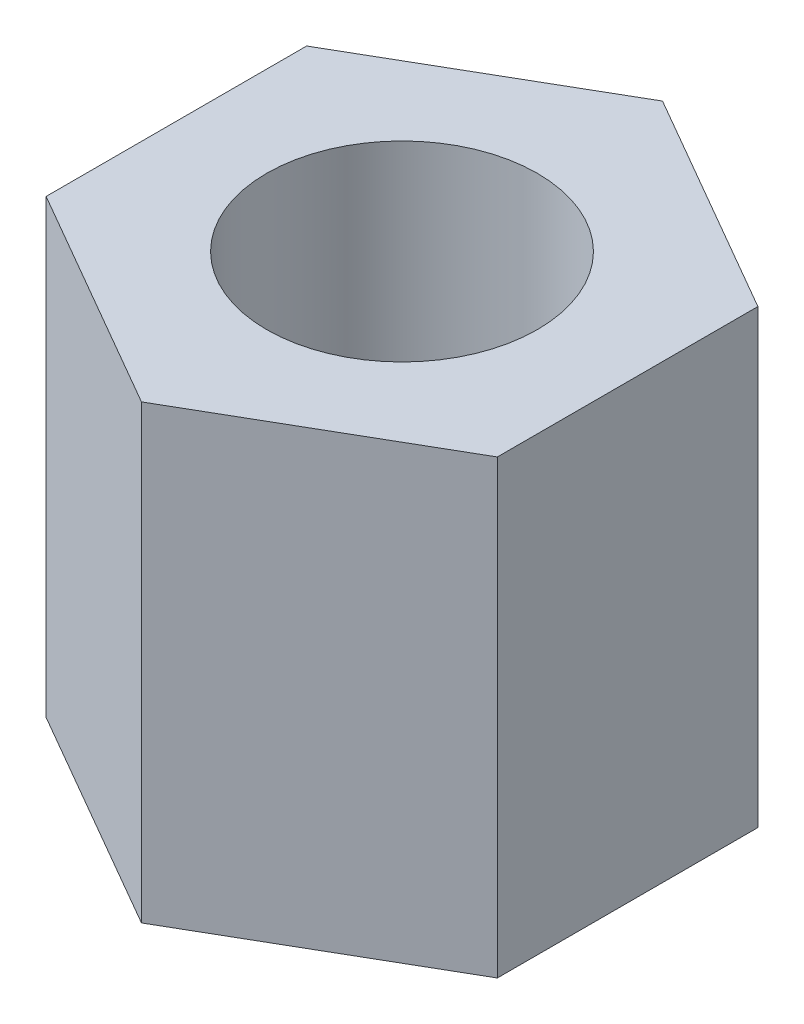
ISO-10303-21;
HEADER;
FILE_DESCRIPTION(('STEP AP214'),'2;1');
FILE_NAME('part.step','',(''),(''),'','','');
FILE_SCHEMA(('AUTOMOTIVE_DESIGN { 1 0 10303 214 1 1 1 1 }'));
ENDSEC;
DATA;
#1=APPLICATION_CONTEXT('core data for automotive mechanical design processes');
#2=APPLICATION_PROTOCOL_DEFINITION('international standard','automotive_design',2000,#1);
#3=PRODUCT_CONTEXT('',#1,'mechanical');
#4=PRODUCT('Part','Part','',(#3));
#5=PRODUCT_RELATED_PRODUCT_CATEGORY('part','',(#4));
#6=PRODUCT_DEFINITION_FORMATION('','',#4);
#7=PRODUCT_DEFINITION_CONTEXT('part definition',#1,'design');
#8=PRODUCT_DEFINITION('design','',#6,#7);
#9=PRODUCT_DEFINITION_SHAPE('','',#8);
#10=(LENGTH_UNIT() NAMED_UNIT(*) SI_UNIT(.MILLI.,.METRE.));
#11=(NAMED_UNIT(*) PLANE_ANGLE_UNIT() SI_UNIT($,.RADIAN.));
#12=(NAMED_UNIT(*) SI_UNIT($,.STERADIAN.) SOLID_ANGLE_UNIT());
#13=UNCERTAINTY_MEASURE_WITH_UNIT(LENGTH_MEASURE(1.E-05),#10,'distance_accuracy_value','');
#14=(GEOMETRIC_REPRESENTATION_CONTEXT(3) GLOBAL_UNCERTAINTY_ASSIGNED_CONTEXT((#13)) GLOBAL_UNIT_ASSIGNED_CONTEXT((#10,
#11,#12)) REPRESENTATION_CONTEXT('',''));
#15=CARTESIAN_POINT('',(0.,0.,0.));
#16=DIRECTION('',(0.,0.,1.));
#17=DIRECTION('',(1.,0.,0.));
#18=AXIS2_PLACEMENT_3D('',#15,#16,#17);
#19=CARTESIAN_POINT('',(0.,5.,0.));
#20=DIRECTION('',(0.,1.,0.));
#21=DIRECTION('',(0.,0.,1.));
#22=AXIS2_PLACEMENT_3D('',#19,#20,#21);
#23=PLANE('',#22);
#24=DIRECTION('',(-0.866025403784439,0.,-0.5));
#25=VECTOR('',#24,1.);
#26=CARTESIAN_POINT('',(2.5,5.,-1.44337567297407));
#27=LINE('',#26,#25);
#28=CARTESIAN_POINT('',(2.5,5.,-1.44337567297407));
#29=VERTEX_POINT('',#28);
#30=CARTESIAN_POINT('',(0.,5.,-2.88675134594813));
#31=VERTEX_POINT('',#30);
#32=EDGE_CURVE('E129',#29,#31,#27,.T.);
#33=ORIENTED_EDGE('',*,*,#32,.T.);
#34=DIRECTION('',(-0.866025403784439,0.,0.5));
#35=VECTOR('',#34,1.);
#36=CARTESIAN_POINT('',(0.,5.,-2.88675134594813));
#37=LINE('',#36,#35);
#38=CARTESIAN_POINT('',(-2.5,5.,-1.44337567297407));
#39=VERTEX_POINT('',#38);
#40=EDGE_CURVE('E87',#31,#39,#37,.T.);
#41=ORIENTED_EDGE('',*,*,#40,.T.);
#42=DIRECTION('',(0.,0.,1.));
#43=VECTOR('',#42,1.);
#44=CARTESIAN_POINT('',(-2.5,5.,-1.44337567297407));
#45=LINE('',#44,#43);
#46=CARTESIAN_POINT('',(-2.5,5.,1.44337567297406));
#47=VERTEX_POINT('',#46);
#48=EDGE_CURVE('E100',#39,#47,#45,.T.);
#49=ORIENTED_EDGE('',*,*,#48,.T.);
#50=DIRECTION('',(0.866025403784439,0.,0.5));
#51=VECTOR('',#50,1.);
#52=CARTESIAN_POINT('',(-2.5,5.,1.44337567297406));
#53=LINE('',#52,#51);
#54=CARTESIAN_POINT('',(0.,5.,2.88675134594813));
#55=VERTEX_POINT('',#54);
#56=EDGE_CURVE('E94',#47,#55,#53,.T.);
#57=ORIENTED_EDGE('',*,*,#56,.T.);
#58=DIRECTION('',(0.866025403784439,0.,-0.5));
#59=VECTOR('',#58,1.);
#60=CARTESIAN_POINT('',(0.,5.,2.88675134594813));
#61=LINE('',#60,#59);
#62=CARTESIAN_POINT('',(2.5,5.,1.44337567297407));
#63=VERTEX_POINT('',#62);
#64=EDGE_CURVE('E98',#55,#63,#61,.T.);
#65=ORIENTED_EDGE('',*,*,#64,.T.);
#66=DIRECTION('',(0.,0.,-1.));
#67=VECTOR('',#66,1.);
#68=CARTESIAN_POINT('',(2.5,5.,1.44337567297407));
#69=LINE('',#68,#67);
#70=EDGE_CURVE('E50',#63,#29,#69,.T.);
#71=ORIENTED_EDGE('',*,*,#70,.T.);
#72=EDGE_LOOP('',(#33,#41,#49,#57,#65,#71));
#73=FACE_BOUND('',#72,.T.);
#74=CARTESIAN_POINT('',(0.,5.,0.));
#75=DIRECTION('',(0.,1.,0.));
#76=DIRECTION('',(0.,0.,1.));
#77=AXIS2_PLACEMENT_3D('',#74,#75,#76);
#78=CIRCLE('',#77,1.5);
#79=CARTESIAN_POINT('',(0.,5.,1.5));
#80=VERTEX_POINT('',#79);
#81=EDGE_CURVE('E122',#80,#80,#78,.T.);
#82=ORIENTED_EDGE('',*,*,#81,.F.);
#83=EDGE_LOOP('',(#82));
#84=FACE_BOUND('',#83,.T.);
#85=ADVANCED_FACE('F33',(#73,#84),#23,.T.);
#86=CARTESIAN_POINT('',(0.,0.,0.));
#87=DIRECTION('',(0.,1.,0.));
#88=DIRECTION('',(0.,0.,1.));
#89=AXIS2_PLACEMENT_3D('',#86,#87,#88);
#90=PLANE('',#89);
#91=DIRECTION('',(-0.866025403784439,0.,-0.5));
#92=VECTOR('',#91,1.);
#93=CARTESIAN_POINT('',(2.5,0.,-1.44337567297407));
#94=LINE('',#93,#92);
#95=CARTESIAN_POINT('',(2.5,0.,-1.44337567297407));
#96=VERTEX_POINT('',#95);
#97=CARTESIAN_POINT('',(0.,0.,-2.88675134594813));
#98=VERTEX_POINT('',#97);
#99=EDGE_CURVE('E118',#96,#98,#94,.T.);
#100=ORIENTED_EDGE('',*,*,#99,.F.);
#101=DIRECTION('',(0.,0.,-1.));
#102=VECTOR('',#101,1.);
#103=CARTESIAN_POINT('',(2.5,0.,1.44337567297407));
#104=LINE('',#103,#102);
#105=CARTESIAN_POINT('',(2.5,0.,1.44337567297407));
#106=VERTEX_POINT('',#105);
#107=EDGE_CURVE('E79',#106,#96,#104,.T.);
#108=ORIENTED_EDGE('',*,*,#107,.F.);
#109=DIRECTION('',(0.866025403784439,0.,-0.5));
#110=VECTOR('',#109,1.);
#111=CARTESIAN_POINT('',(0.,0.,2.88675134594813));
#112=LINE('',#111,#110);
#113=CARTESIAN_POINT('',(0.,0.,2.88675134594813));
#114=VERTEX_POINT('',#113);
#115=EDGE_CURVE('E73',#114,#106,#112,.T.);
#116=ORIENTED_EDGE('',*,*,#115,.F.);
#117=DIRECTION('',(0.866025403784439,0.,0.5));
#118=VECTOR('',#117,1.);
#119=CARTESIAN_POINT('',(-2.5,0.,1.44337567297406));
#120=LINE('',#119,#118);
#121=CARTESIAN_POINT('',(-2.5,0.,1.44337567297406));
#122=VERTEX_POINT('',#121);
#123=EDGE_CURVE('E108',#122,#114,#120,.T.);
#124=ORIENTED_EDGE('',*,*,#123,.F.);
#125=DIRECTION('',(0.,0.,1.));
#126=VECTOR('',#125,1.);
#127=CARTESIAN_POINT('',(-2.5,0.,-1.44337567297407));
#128=LINE('',#127,#126);
#129=CARTESIAN_POINT('',(-2.5,0.,-1.44337567297407));
#130=VERTEX_POINT('',#129);
#131=EDGE_CURVE('E124',#130,#122,#128,.T.);
#132=ORIENTED_EDGE('',*,*,#131,.F.);
#133=DIRECTION('',(-0.866025403784439,0.,0.5));
#134=VECTOR('',#133,1.);
#135=CARTESIAN_POINT('',(0.,0.,-2.88675134594813));
#136=LINE('',#135,#134);
#137=EDGE_CURVE('E121',#98,#130,#136,.T.);
#138=ORIENTED_EDGE('',*,*,#137,.F.);
#139=EDGE_LOOP('',(#100,#108,#116,#124,#132,#138));
#140=FACE_BOUND('',#139,.T.);
#141=CARTESIAN_POINT('',(0.,0.,0.));
#142=DIRECTION('',(0.,1.,0.));
#143=DIRECTION('',(0.,0.,1.));
#144=AXIS2_PLACEMENT_3D('',#141,#142,#143);
#145=CIRCLE('',#144,1.5);
#146=CARTESIAN_POINT('',(0.,0.,1.5));
#147=VERTEX_POINT('',#146);
#148=EDGE_CURVE('E222',#147,#147,#145,.T.);
#149=ORIENTED_EDGE('',*,*,#148,.T.);
#150=EDGE_LOOP('',(#149));
#151=FACE_BOUND('',#150,.T.);
#152=ADVANCED_FACE('F138',(#140,#151),#90,.F.);
#153=CARTESIAN_POINT('',(2.5,5.,-1.44337567297407));
#154=DIRECTION('',(-0.5,0.,0.866025403784439));
#155=DIRECTION('',(0.866025403784439,0.,0.5));
#156=AXIS2_PLACEMENT_3D('',#153,#154,#155);
#157=PLANE('',#156);
#158=ORIENTED_EDGE('',*,*,#99,.T.);
#159=DIRECTION('',(0.,-1.,0.));
#160=VECTOR('',#159,1.);
#161=CARTESIAN_POINT('',(0.,5.,-2.88675134594813));
#162=LINE('',#161,#160);
#163=EDGE_CURVE('E11',#31,#98,#162,.T.);
#164=ORIENTED_EDGE('',*,*,#163,.F.);
#165=ORIENTED_EDGE('',*,*,#32,.F.);
#166=DIRECTION('',(0.,-1.,0.));
#167=VECTOR('',#166,1.);
#168=CARTESIAN_POINT('',(2.5,5.,-1.44337567297407));
#169=LINE('',#168,#167);
#170=EDGE_CURVE('E114',#29,#96,#169,.T.);
#171=ORIENTED_EDGE('',*,*,#170,.T.);
#172=EDGE_LOOP('',(#158,#164,#165,#171));
#173=FACE_BOUND('',#172,.T.);
#174=ADVANCED_FACE('F35',(#173),#157,.F.);
#175=CARTESIAN_POINT('',(0.,5.,-2.88675134594813));
#176=DIRECTION('',(0.5,0.,0.866025403784439));
#177=DIRECTION('',(0.866025403784439,0.,-0.5));
#178=AXIS2_PLACEMENT_3D('',#175,#176,#177);
#179=PLANE('',#178);
#180=ORIENTED_EDGE('',*,*,#137,.T.);
#181=DIRECTION('',(0.,-1.,0.));
#182=VECTOR('',#181,1.);
#183=CARTESIAN_POINT('',(-2.5,5.,-1.44337567297407));
#184=LINE('',#183,#182);
#185=EDGE_CURVE('E42',#39,#130,#184,.T.);
#186=ORIENTED_EDGE('',*,*,#185,.F.);
#187=ORIENTED_EDGE('',*,*,#40,.F.);
#188=ORIENTED_EDGE('',*,*,#163,.T.);
#189=EDGE_LOOP('',(#180,#186,#187,#188));
#190=FACE_BOUND('',#189,.T.);
#191=ADVANCED_FACE('F163',(#190),#179,.F.);
#192=CARTESIAN_POINT('',(-2.5,5.,-1.44337567297407));
#193=DIRECTION('',(1.,0.,0.));
#194=DIRECTION('',(0.,0.,-1.));
#195=AXIS2_PLACEMENT_3D('',#192,#193,#194);
#196=PLANE('',#195);
#197=ORIENTED_EDGE('',*,*,#131,.T.);
#198=DIRECTION('',(0.,-1.,0.));
#199=VECTOR('',#198,1.);
#200=CARTESIAN_POINT('',(-2.5,5.,1.44337567297406));
#201=LINE('',#200,#199);
#202=EDGE_CURVE('E109',#47,#122,#201,.T.);
#203=ORIENTED_EDGE('',*,*,#202,.F.);
#204=ORIENTED_EDGE('',*,*,#48,.F.);
#205=ORIENTED_EDGE('',*,*,#185,.T.);
#206=EDGE_LOOP('',(#197,#203,#204,#205));
#207=FACE_BOUND('',#206,.T.);
#208=ADVANCED_FACE('F135',(#207),#196,.F.);
#209=CARTESIAN_POINT('',(-2.5,5.,1.44337567297406));
#210=DIRECTION('',(0.5,0.,-0.866025403784439));
#211=DIRECTION('',(-0.866025403784439,0.,-0.5));
#212=AXIS2_PLACEMENT_3D('',#209,#210,#211);
#213=PLANE('',#212);
#214=ORIENTED_EDGE('',*,*,#123,.T.);
#215=DIRECTION('',(0.,-1.,0.));
#216=VECTOR('',#215,1.);
#217=CARTESIAN_POINT('',(0.,5.,2.88675134594813));
#218=LINE('',#217,#216);
#219=EDGE_CURVE('E105',#55,#114,#218,.T.);
#220=ORIENTED_EDGE('',*,*,#219,.F.);
#221=ORIENTED_EDGE('',*,*,#56,.F.);
#222=ORIENTED_EDGE('',*,*,#202,.T.);
#223=EDGE_LOOP('',(#214,#220,#221,#222));
#224=FACE_BOUND('',#223,.T.);
#225=ADVANCED_FACE('F106',(#224),#213,.F.);
#226=CARTESIAN_POINT('',(0.,5.,2.88675134594813));
#227=DIRECTION('',(-0.5,0.,-0.866025403784439));
#228=DIRECTION('',(-0.866025403784439,0.,0.5));
#229=AXIS2_PLACEMENT_3D('',#226,#227,#228);
#230=PLANE('',#229);
#231=ORIENTED_EDGE('',*,*,#115,.T.);
#232=DIRECTION('',(0.,-1.,0.));
#233=VECTOR('',#232,1.);
#234=CARTESIAN_POINT('',(2.5,5.,1.44337567297407));
#235=LINE('',#234,#233);
#236=EDGE_CURVE('E110',#63,#106,#235,.T.);
#237=ORIENTED_EDGE('',*,*,#236,.F.);
#238=ORIENTED_EDGE('',*,*,#64,.F.);
#239=ORIENTED_EDGE('',*,*,#219,.T.);
#240=EDGE_LOOP('',(#231,#237,#238,#239));
#241=FACE_BOUND('',#240,.T.);
#242=ADVANCED_FACE('F112',(#241),#230,.F.);
#243=CARTESIAN_POINT('',(2.5,5.,1.44337567297407));
#244=DIRECTION('',(-1.,0.,0.));
#245=DIRECTION('',(0.,0.,1.));
#246=AXIS2_PLACEMENT_3D('',#243,#244,#245);
#247=PLANE('',#246);
#248=ORIENTED_EDGE('',*,*,#107,.T.);
#249=ORIENTED_EDGE('',*,*,#170,.F.);
#250=ORIENTED_EDGE('',*,*,#70,.F.);
#251=ORIENTED_EDGE('',*,*,#236,.T.);
#252=EDGE_LOOP('',(#248,#249,#250,#251));
#253=FACE_BOUND('',#252,.T.);
#254=ADVANCED_FACE('F143',(#253),#247,.F.);
#255=CARTESIAN_POINT('',(0.,5.,0.));
#256=DIRECTION('',(0.,-1.,0.));
#257=DIRECTION('',(0.,0.,-1.));
#258=AXIS2_PLACEMENT_3D('',#255,#256,#257);
#259=CYLINDRICAL_SURFACE('',#258,1.5);
#260=ORIENTED_EDGE('',*,*,#81,.T.);
#261=EDGE_LOOP('',(#260));
#262=FACE_BOUND('',#261,.T.);
#263=ORIENTED_EDGE('',*,*,#148,.F.);
#264=EDGE_LOOP('',(#263));
#265=FACE_BOUND('',#264,.T.);
#266=ADVANCED_FACE('F145',(#262,#265),#259,.F.);
#267=CLOSED_SHELL('',(#85,#152,#174,#191,#208,#225,#242,#254,#266));
#268=MANIFOLD_SOLID_BREP('B2',#267);
#269=ADVANCED_BREP_SHAPE_REPRESENTATION('',(#18,#268),#14);
#270=SHAPE_DEFINITION_REPRESENTATION(#9,#269);
ENDSEC;
END-ISO-10303-21;
